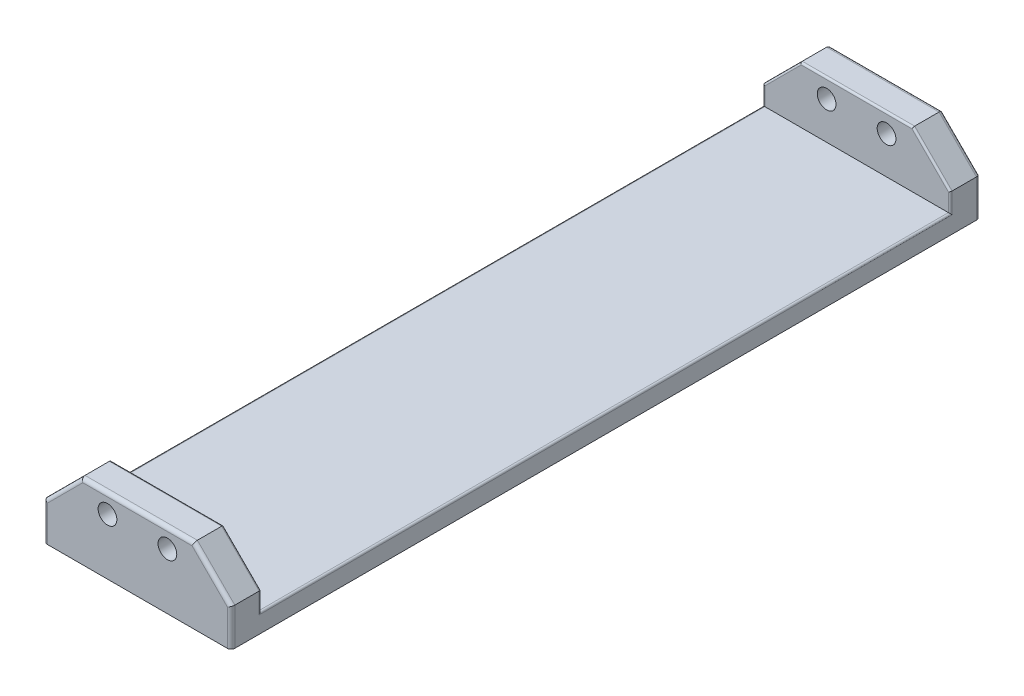
ISO-10303-21;
HEADER;
FILE_DESCRIPTION(('STEP AP214'),'2;1');
FILE_NAME('part.step','',(''),(''),'','','');
FILE_SCHEMA(('AUTOMOTIVE_DESIGN { 1 0 10303 214 1 1 1 1 }'));
ENDSEC;
DATA;
#1=APPLICATION_CONTEXT('core data for automotive mechanical design processes');
#2=APPLICATION_PROTOCOL_DEFINITION('international standard','automotive_design',2000,#1);
#3=PRODUCT_CONTEXT('',#1,'mechanical');
#4=PRODUCT('Part','Part','',(#3));
#5=PRODUCT_RELATED_PRODUCT_CATEGORY('part','',(#4));
#6=PRODUCT_DEFINITION_FORMATION('','',#4);
#7=PRODUCT_DEFINITION_CONTEXT('part definition',#1,'design');
#8=PRODUCT_DEFINITION('design','',#6,#7);
#9=PRODUCT_DEFINITION_SHAPE('','',#8);
#10=(LENGTH_UNIT() NAMED_UNIT(*) SI_UNIT(.MILLI.,.METRE.));
#11=(NAMED_UNIT(*) PLANE_ANGLE_UNIT() SI_UNIT($,.RADIAN.));
#12=(NAMED_UNIT(*) SI_UNIT($,.STERADIAN.) SOLID_ANGLE_UNIT());
#13=UNCERTAINTY_MEASURE_WITH_UNIT(LENGTH_MEASURE(1.E-05),#10,'distance_accuracy_value','');
#14=(GEOMETRIC_REPRESENTATION_CONTEXT(3) GLOBAL_UNCERTAINTY_ASSIGNED_CONTEXT((#13)) GLOBAL_UNIT_ASSIGNED_CONTEXT((#10,
#11,#12)) REPRESENTATION_CONTEXT('',''));
#15=CARTESIAN_POINT('',(0.,0.,0.));
#16=DIRECTION('',(0.,0.,1.));
#17=DIRECTION('',(1.,0.,0.));
#18=AXIS2_PLACEMENT_3D('',#15,#16,#17);
#19=CARTESIAN_POINT('',(-250.,100.,2000.));
#20=DIRECTION('',(0.,-1.,0.));
#21=DIRECTION('',(0.,0.,-1.));
#22=AXIS2_PLACEMENT_3D('',#19,#20,#21);
#23=PLANE('',#22);
#24=DIRECTION('',(0.,0.,1.));
#25=VECTOR('',#24,1.);
#26=CARTESIAN_POINT('',(-150.000000000001,100.,0.));
#27=LINE('',#26,#25);
#28=CARTESIAN_POINT('',(-150.000000000001,100.,10.));
#29=VERTEX_POINT('',#28);
#30=CARTESIAN_POINT('',(-150.000000000001,100.,75.0000000000001));
#31=VERTEX_POINT('',#30);
#32=EDGE_CURVE('E410',#29,#31,#27,.T.);
#33=ORIENTED_EDGE('',*,*,#32,.T.);
#34=DIRECTION('',(-1.,0.,0.));
#35=VECTOR('',#34,1.);
#36=CARTESIAN_POINT('',(-250.,100.,75.0000000000002));
#37=LINE('',#36,#35);
#38=CARTESIAN_POINT('',(150.,100.,75.0000000000001));
#39=VERTEX_POINT('',#38);
#40=EDGE_CURVE('E58',#31,#39,#37,.F.);
#41=ORIENTED_EDGE('',*,*,#40,.T.);
#42=DIRECTION('',(0.,0.,1.));
#43=VECTOR('',#42,1.);
#44=CARTESIAN_POINT('',(150.,100.,0.));
#45=LINE('',#44,#43);
#46=CARTESIAN_POINT('',(150.,100.,10.));
#47=VERTEX_POINT('',#46);
#48=EDGE_CURVE('E393',#47,#39,#45,.T.);
#49=ORIENTED_EDGE('',*,*,#48,.F.);
#50=DIRECTION('',(-1.,0.,0.));
#51=VECTOR('',#50,1.);
#52=CARTESIAN_POINT('',(-250.,100.,10.));
#53=LINE('',#52,#51);
#54=EDGE_CURVE('E276',#47,#29,#53,.T.);
#55=ORIENTED_EDGE('',*,*,#54,.T.);
#56=EDGE_LOOP('',(#33,#41,#49,#55));
#57=FACE_BOUND('',#56,.T.);
#58=ADVANCED_FACE('F34',(#57),#23,.F.);
#59=CARTESIAN_POINT('',(250.,100.,2000.));
#60=DIRECTION('',(-1.,0.,0.));
#61=DIRECTION('',(0.,0.,1.));
#62=AXIS2_PLACEMENT_3D('',#59,#60,#61);
#63=PLANE('',#62);
#64=DIRECTION('',(0.,0.,1.));
#65=VECTOR('',#64,1.);
#66=CARTESIAN_POINT('',(250.,-55.,2000.));
#67=LINE('',#66,#65);
#68=CARTESIAN_POINT('',(250.,-55.,75.0000000000001));
#69=VERTEX_POINT('',#68);
#70=CARTESIAN_POINT('',(250.,-55.,1925.));
#71=VERTEX_POINT('',#70);
#72=EDGE_CURVE('E317',#69,#71,#67,.T.);
#73=ORIENTED_EDGE('',*,*,#72,.T.);
#74=DIRECTION('',(0.,1.,0.));
#75=VECTOR('',#74,1.);
#76=CARTESIAN_POINT('',(250.,100.,1925.));
#77=LINE('',#76,#75);
#78=CARTESIAN_POINT('',(250.,0.,1925.));
#79=VERTEX_POINT('',#78);
#80=EDGE_CURVE('E321',#71,#79,#77,.T.);
#81=ORIENTED_EDGE('',*,*,#80,.T.);
#82=DIRECTION('',(0.,0.,1.));
#83=VECTOR('',#82,1.);
#84=CARTESIAN_POINT('',(250.,0.,0.));
#85=LINE('',#84,#83);
#86=CARTESIAN_POINT('',(250.,0.,1990.));
#87=VERTEX_POINT('',#86);
#88=EDGE_CURVE('E400',#79,#87,#85,.T.);
#89=ORIENTED_EDGE('',*,*,#88,.T.);
#90=DIRECTION('',(0.,1.,0.));
#91=VECTOR('',#90,1.);
#92=CARTESIAN_POINT('',(250.,-100.,1990.));
#93=LINE('',#92,#91);
#94=CARTESIAN_POINT('',(250.,-100.,1990.));
#95=VERTEX_POINT('',#94);
#96=EDGE_CURVE('E228',#87,#95,#93,.F.);
#97=ORIENTED_EDGE('',*,*,#96,.T.);
#98=DIRECTION('',(0.,0.,-1.));
#99=VECTOR('',#98,1.);
#100=CARTESIAN_POINT('',(250.,-100.,2000.));
#101=LINE('',#100,#99);
#102=CARTESIAN_POINT('',(250.,-100.,10.));
#103=VERTEX_POINT('',#102);
#104=EDGE_CURVE('E221',#95,#103,#101,.T.);
#105=ORIENTED_EDGE('',*,*,#104,.T.);
#106=DIRECTION('',(0.,1.,0.));
#107=VECTOR('',#106,1.);
#108=CARTESIAN_POINT('',(250.,100.,10.));
#109=LINE('',#108,#107);
#110=CARTESIAN_POINT('',(250.,0.,10.));
#111=VERTEX_POINT('',#110);
#112=EDGE_CURVE('E280',#103,#111,#109,.T.);
#113=ORIENTED_EDGE('',*,*,#112,.T.);
#114=CARTESIAN_POINT('',(250.,0.,75.));
#115=VERTEX_POINT('',#114);
#116=EDGE_CURVE('E391',#111,#115,#85,.T.);
#117=ORIENTED_EDGE('',*,*,#116,.T.);
#118=DIRECTION('',(0.,-1.,0.));
#119=VECTOR('',#118,1.);
#120=CARTESIAN_POINT('',(250.,100.000000000001,75.0000000000002));
#121=LINE('',#120,#119);
#122=EDGE_CURVE('E319',#115,#69,#121,.T.);
#123=ORIENTED_EDGE('',*,*,#122,.T.);
#124=EDGE_LOOP('',(#73,#81,#89,#97,#105,#113,#117,#123));
#125=FACE_BOUND('',#124,.T.);
#126=ADVANCED_FACE('F395',(#125),#63,.F.);
#127=CARTESIAN_POINT('',(150.,100.,1925.));
#128=VERTEX_POINT('',#127);
#129=CARTESIAN_POINT('',(150.,100.,1990.));
#130=VERTEX_POINT('',#129);
#131=EDGE_CURVE('E409',#128,#130,#45,.T.);
#132=ORIENTED_EDGE('',*,*,#131,.F.);
#133=DIRECTION('',(-1.,0.,0.));
#134=VECTOR('',#133,1.);
#135=CARTESIAN_POINT('',(-250.,100.,1925.));
#136=LINE('',#135,#134);
#137=CARTESIAN_POINT('',(-150.000000000001,100.,1925.));
#138=VERTEX_POINT('',#137);
#139=EDGE_CURVE('E315',#128,#138,#136,.T.);
#140=ORIENTED_EDGE('',*,*,#139,.T.);
#141=CARTESIAN_POINT('',(-150.000000000001,100.,1990.));
#142=VERTEX_POINT('',#141);
#143=EDGE_CURVE('E412',#138,#142,#27,.T.);
#144=ORIENTED_EDGE('',*,*,#143,.T.);
#145=DIRECTION('',(-1.,0.,0.));
#146=VECTOR('',#145,1.);
#147=CARTESIAN_POINT('',(150.,100.,1990.));
#148=LINE('',#147,#146);
#149=EDGE_CURVE('E238',#142,#130,#148,.F.);
#150=ORIENTED_EDGE('',*,*,#149,.T.);
#151=EDGE_LOOP('',(#132,#140,#144,#150));
#152=FACE_BOUND('',#151,.T.);
#153=ADVANCED_FACE('F495',(#152),#23,.F.);
#154=CARTESIAN_POINT('',(-250.,100.,2000.));
#155=DIRECTION('',(1.,0.,0.));
#156=DIRECTION('',(0.,0.,-1.));
#157=AXIS2_PLACEMENT_3D('',#154,#155,#156);
#158=PLANE('',#157);
#159=DIRECTION('',(0.,0.,1.));
#160=VECTOR('',#159,1.);
#161=CARTESIAN_POINT('',(-250.,0.,0.));
#162=LINE('',#161,#160);
#163=CARTESIAN_POINT('',(-250.,0.,1925.));
#164=VERTEX_POINT('',#163);
#165=CARTESIAN_POINT('',(-250.,0.,1990.));
#166=VERTEX_POINT('',#165);
#167=EDGE_CURVE('E399',#164,#166,#162,.T.);
#168=ORIENTED_EDGE('',*,*,#167,.F.);
#169=DIRECTION('',(0.,1.,0.));
#170=VECTOR('',#169,1.);
#171=CARTESIAN_POINT('',(-250.,100.,1925.));
#172=LINE('',#171,#170);
#173=CARTESIAN_POINT('',(-250.,-55.,1925.));
#174=VERTEX_POINT('',#173);
#175=EDGE_CURVE('E311',#164,#174,#172,.F.);
#176=ORIENTED_EDGE('',*,*,#175,.T.);
#177=DIRECTION('',(0.,0.,1.));
#178=VECTOR('',#177,1.);
#179=CARTESIAN_POINT('',(-250.,-55.,2000.));
#180=LINE('',#179,#178);
#181=CARTESIAN_POINT('',(-250.,-55.,75.));
#182=VERTEX_POINT('',#181);
#183=EDGE_CURVE('E307',#174,#182,#180,.F.);
#184=ORIENTED_EDGE('',*,*,#183,.T.);
#185=DIRECTION('',(0.,-1.,0.));
#186=VECTOR('',#185,1.);
#187=CARTESIAN_POINT('',(-250.,100.000000000001,75.));
#188=LINE('',#187,#186);
#189=CARTESIAN_POINT('',(-250.,0.,75.));
#190=VERTEX_POINT('',#189);
#191=EDGE_CURVE('E309',#182,#190,#188,.F.);
#192=ORIENTED_EDGE('',*,*,#191,.T.);
#193=CARTESIAN_POINT('',(-250.,0.,10.));
#194=VERTEX_POINT('',#193);
#195=EDGE_CURVE('E402',#194,#190,#162,.T.);
#196=ORIENTED_EDGE('',*,*,#195,.F.);
#197=DIRECTION('',(0.,-1.,0.));
#198=VECTOR('',#197,1.);
#199=CARTESIAN_POINT('',(-250.,100.,10.));
#200=LINE('',#199,#198);
#201=CARTESIAN_POINT('',(-250.,-100.,10.));
#202=VERTEX_POINT('',#201);
#203=EDGE_CURVE('E245',#194,#202,#200,.T.);
#204=ORIENTED_EDGE('',*,*,#203,.T.);
#205=DIRECTION('',(0.,0.,-1.));
#206=VECTOR('',#205,1.);
#207=CARTESIAN_POINT('',(-250.,-100.,2000.));
#208=LINE('',#207,#206);
#209=CARTESIAN_POINT('',(-250.,-100.,1990.));
#210=VERTEX_POINT('',#209);
#211=EDGE_CURVE('E211',#210,#202,#208,.T.);
#212=ORIENTED_EDGE('',*,*,#211,.F.);
#213=DIRECTION('',(0.,-1.,0.));
#214=VECTOR('',#213,1.);
#215=CARTESIAN_POINT('',(-250.,0.,1990.));
#216=LINE('',#215,#214);
#217=EDGE_CURVE('E227',#210,#166,#216,.F.);
#218=ORIENTED_EDGE('',*,*,#217,.T.);
#219=EDGE_LOOP('',(#168,#176,#184,#192,#196,#204,#212,#218));
#220=FACE_BOUND('',#219,.T.);
#221=ADVANCED_FACE('F460',(#220),#158,.F.);
#222=CARTESIAN_POINT('',(-250.,-100.,2000.));
#223=DIRECTION('',(0.,1.,0.));
#224=DIRECTION('',(0.,0.,1.));
#225=AXIS2_PLACEMENT_3D('',#222,#223,#224);
#226=PLANE('',#225);
#227=ORIENTED_EDGE('',*,*,#211,.T.);
#228=CARTESIAN_POINT('',(-240.,-100.,10.));
#229=DIRECTION('',(0.,1.,0.));
#230=DIRECTION('',(0.,0.,1.));
#231=AXIS2_PLACEMENT_3D('',#228,#229,#230);
#232=CIRCLE('',#231,10.);
#233=CARTESIAN_POINT('',(-240.,-100.,0.));
#234=VERTEX_POINT('',#233);
#235=EDGE_CURVE('E262',#202,#234,#232,.F.);
#236=ORIENTED_EDGE('',*,*,#235,.T.);
#237=DIRECTION('',(1.,0.,0.));
#238=VECTOR('',#237,1.);
#239=CARTESIAN_POINT('',(-250.,-100.,0.));
#240=LINE('',#239,#238);
#241=CARTESIAN_POINT('',(240.,-100.,0.));
#242=VERTEX_POINT('',#241);
#243=EDGE_CURVE('E222',#234,#242,#240,.T.);
#244=ORIENTED_EDGE('',*,*,#243,.T.);
#245=CARTESIAN_POINT('',(240.,-100.,10.));
#246=DIRECTION('',(0.,1.,0.));
#247=DIRECTION('',(0.,0.,1.));
#248=AXIS2_PLACEMENT_3D('',#245,#246,#247);
#249=CIRCLE('',#248,10.);
#250=EDGE_CURVE('E260',#242,#103,#249,.F.);
#251=ORIENTED_EDGE('',*,*,#250,.T.);
#252=ORIENTED_EDGE('',*,*,#104,.F.);
#253=CARTESIAN_POINT('',(240.,-100.,1990.));
#254=DIRECTION('',(0.,1.,0.));
#255=DIRECTION('',(0.,0.,1.));
#256=AXIS2_PLACEMENT_3D('',#253,#254,#255);
#257=CIRCLE('',#256,10.);
#258=CARTESIAN_POINT('',(240.,-100.,2000.));
#259=VERTEX_POINT('',#258);
#260=EDGE_CURVE('E220',#95,#259,#257,.F.);
#261=ORIENTED_EDGE('',*,*,#260,.T.);
#262=DIRECTION('',(1.,0.,0.));
#263=VECTOR('',#262,1.);
#264=CARTESIAN_POINT('',(-250.,-100.,2000.));
#265=LINE('',#264,#263);
#266=CARTESIAN_POINT('',(-240.,-100.,2000.));
#267=VERTEX_POINT('',#266);
#268=EDGE_CURVE('E203',#267,#259,#265,.T.);
#269=ORIENTED_EDGE('',*,*,#268,.F.);
#270=CARTESIAN_POINT('',(-240.,-100.,1990.));
#271=DIRECTION('',(0.,1.,0.));
#272=DIRECTION('',(0.,0.,1.));
#273=AXIS2_PLACEMENT_3D('',#270,#271,#272);
#274=CIRCLE('',#273,10.);
#275=EDGE_CURVE('E216',#267,#210,#274,.F.);
#276=ORIENTED_EDGE('',*,*,#275,.T.);
#277=EDGE_LOOP('',(#227,#236,#244,#251,#252,#261,#269,#276));
#278=FACE_BOUND('',#277,.T.);
#279=ADVANCED_FACE('F215',(#278),#226,.F.);
#280=CARTESIAN_POINT('',(0.,0.,2000.));
#281=DIRECTION('',(0.,0.,1.));
#282=DIRECTION('',(1.,0.,0.));
#283=AXIS2_PLACEMENT_3D('',#280,#281,#282);
#284=PLANE('',#283);
#285=CARTESIAN_POINT('',(80.,50.,2000.));
#286=DIRECTION('',(0.,0.,1.));
#287=DIRECTION('',(1.,0.,0.));
#288=AXIS2_PLACEMENT_3D('',#285,#286,#287);
#289=CIRCLE('',#288,25.);
#290=CARTESIAN_POINT('',(105.,50.,2000.));
#291=VERTEX_POINT('',#290);
#292=EDGE_CURVE('E257',#291,#291,#289,.T.);
#293=ORIENTED_EDGE('',*,*,#292,.F.);
#294=EDGE_LOOP('',(#293));
#295=FACE_BOUND('',#294,.T.);
#296=CARTESIAN_POINT('',(-80.,50.,2000.));
#297=DIRECTION('',(0.,0.,1.));
#298=DIRECTION('',(1.,0.,0.));
#299=AXIS2_PLACEMENT_3D('',#296,#297,#298);
#300=CIRCLE('',#299,25.);
#301=CARTESIAN_POINT('',(-55.,50.,2000.));
#302=VERTEX_POINT('',#301);
#303=EDGE_CURVE('E598',#302,#302,#300,.T.);
#304=ORIENTED_EDGE('',*,*,#303,.F.);
#305=EDGE_LOOP('',(#304));
#306=FACE_BOUND('',#305,.T.);
#307=ORIENTED_EDGE('',*,*,#268,.T.);
#308=DIRECTION('',(0.,1.,0.));
#309=VECTOR('',#308,1.);
#310=CARTESIAN_POINT('',(240.,0.,2000.));
#311=LINE('',#310,#309);
#312=CARTESIAN_POINT('',(240.,-4.14213562373096,2000.));
#313=VERTEX_POINT('',#312);
#314=EDGE_CURVE('E232',#259,#313,#311,.T.);
#315=ORIENTED_EDGE('',*,*,#314,.T.);
#316=DIRECTION('',(0.707106781186549,-0.707106781186546,0.));
#317=VECTOR('',#316,1.);
#318=CARTESIAN_POINT('',(142.928932188134,92.9289321881345,2000.));
#319=LINE('',#318,#317);
#320=CARTESIAN_POINT('',(145.857864376269,90.,2000.));
#321=VERTEX_POINT('',#320);
#322=EDGE_CURVE('E435',#313,#321,#319,.F.);
#323=ORIENTED_EDGE('',*,*,#322,.T.);
#324=DIRECTION('',(-1.,0.,0.));
#325=VECTOR('',#324,1.);
#326=CARTESIAN_POINT('',(-150.000000000001,90.,2000.));
#327=LINE('',#326,#325);
#328=CARTESIAN_POINT('',(-145.85786437627,90.,2000.));
#329=VERTEX_POINT('',#328);
#330=EDGE_CURVE('E433',#321,#329,#327,.T.);
#331=ORIENTED_EDGE('',*,*,#330,.T.);
#332=DIRECTION('',(0.707106781186544,0.707106781186552,0.));
#333=VECTOR('',#332,1.);
#334=CARTESIAN_POINT('',(-242.928932188134,-7.07106781186543,2000.));
#335=LINE('',#334,#333);
#336=CARTESIAN_POINT('',(-240.,-4.1421356237309,2000.));
#337=VERTEX_POINT('',#336);
#338=EDGE_CURVE('E206',#329,#337,#335,.F.);
#339=ORIENTED_EDGE('',*,*,#338,.T.);
#340=DIRECTION('',(0.,-1.,0.));
#341=VECTOR('',#340,1.);
#342=CARTESIAN_POINT('',(-240.,-100.,2000.));
#343=LINE('',#342,#341);
#344=EDGE_CURVE('E199',#337,#267,#343,.T.);
#345=ORIENTED_EDGE('',*,*,#344,.T.);
#346=EDGE_LOOP('',(#307,#315,#323,#331,#339,#345));
#347=FACE_BOUND('',#346,.T.);
#348=ADVANCED_FACE('F201',(#295,#306,#347),#284,.T.);
#349=CARTESIAN_POINT('',(0.,0.,0.));
#350=DIRECTION('',(0.,0.,1.));
#351=DIRECTION('',(1.,0.,0.));
#352=AXIS2_PLACEMENT_3D('',#349,#350,#351);
#353=PLANE('',#352);
#354=CARTESIAN_POINT('',(80.,50.,0.));
#355=DIRECTION('',(0.,0.,1.));
#356=DIRECTION('',(1.,0.,0.));
#357=AXIS2_PLACEMENT_3D('',#354,#355,#356);
#358=CIRCLE('',#357,25.);
#359=CARTESIAN_POINT('',(105.,50.,0.));
#360=VERTEX_POINT('',#359);
#361=EDGE_CURVE('E430',#360,#360,#358,.T.);
#362=ORIENTED_EDGE('',*,*,#361,.T.);
#363=EDGE_LOOP('',(#362));
#364=FACE_BOUND('',#363,.T.);
#365=CARTESIAN_POINT('',(-80.,50.,0.));
#366=DIRECTION('',(0.,0.,1.));
#367=DIRECTION('',(1.,0.,0.));
#368=AXIS2_PLACEMENT_3D('',#365,#366,#367);
#369=CIRCLE('',#368,25.);
#370=CARTESIAN_POINT('',(-55.,50.,0.));
#371=VERTEX_POINT('',#370);
#372=EDGE_CURVE('E426',#371,#371,#369,.T.);
#373=ORIENTED_EDGE('',*,*,#372,.T.);
#374=EDGE_LOOP('',(#373));
#375=FACE_BOUND('',#374,.T.);
#376=ORIENTED_EDGE('',*,*,#243,.F.);
#377=DIRECTION('',(0.,-1.,0.));
#378=VECTOR('',#377,1.);
#379=CARTESIAN_POINT('',(-240.,0.,0.));
#380=LINE('',#379,#378);
#381=CARTESIAN_POINT('',(-240.,-4.14213562373088,0.));
#382=VERTEX_POINT('',#381);
#383=EDGE_CURVE('E272',#234,#382,#380,.F.);
#384=ORIENTED_EDGE('',*,*,#383,.T.);
#385=DIRECTION('',(0.707106781186544,0.707106781186552,0.));
#386=VECTOR('',#385,1.);
#387=CARTESIAN_POINT('',(-117.928932188136,117.928932188135,0.));
#388=LINE('',#387,#386);
#389=CARTESIAN_POINT('',(-145.85786437627,90.,0.));
#390=VERTEX_POINT('',#389);
#391=EDGE_CURVE('E270',#382,#390,#388,.T.);
#392=ORIENTED_EDGE('',*,*,#391,.T.);
#393=DIRECTION('',(-1.,0.,0.));
#394=VECTOR('',#393,1.);
#395=CARTESIAN_POINT('',(0.,90.,0.));
#396=LINE('',#395,#394);
#397=CARTESIAN_POINT('',(145.857864376269,90.,0.));
#398=VERTEX_POINT('',#397);
#399=EDGE_CURVE('E268',#390,#398,#396,.F.);
#400=ORIENTED_EDGE('',*,*,#399,.T.);
#401=DIRECTION('',(0.707106781186549,-0.707106781186546,0.));
#402=VECTOR('',#401,1.);
#403=CARTESIAN_POINT('',(117.928932188134,117.928932188135,0.));
#404=LINE('',#403,#402);
#405=CARTESIAN_POINT('',(240.,-4.14213562373097,0.));
#406=VERTEX_POINT('',#405);
#407=EDGE_CURVE('E266',#398,#406,#404,.T.);
#408=ORIENTED_EDGE('',*,*,#407,.T.);
#409=DIRECTION('',(0.,1.,0.));
#410=VECTOR('',#409,1.);
#411=CARTESIAN_POINT('',(240.,0.,0.));
#412=LINE('',#411,#410);
#413=EDGE_CURVE('E264',#406,#242,#412,.F.);
#414=ORIENTED_EDGE('',*,*,#413,.T.);
#415=EDGE_LOOP('',(#376,#384,#392,#400,#408,#414));
#416=FACE_BOUND('',#415,.T.);
#417=ADVANCED_FACE('F468',(#364,#375,#416),#353,.F.);
#418=CARTESIAN_POINT('',(750.,100.,80.0000000000001));
#419=DIRECTION('',(0.,0.,-1.));
#420=DIRECTION('',(0.,1.,0.));
#421=AXIS2_PLACEMENT_3D('',#418,#419,#420);
#422=PLANE('',#421);
#423=DIRECTION('',(-1.,0.,0.));
#424=VECTOR('',#423,1.);
#425=CARTESIAN_POINT('',(750.,-50.,80.));
#426=LINE('',#425,#424);
#427=CARTESIAN_POINT('',(245.,-50.,80.));
#428=VERTEX_POINT('',#427);
#429=CARTESIAN_POINT('',(-245.,-50.,80.));
#430=VERTEX_POINT('',#429);
#431=EDGE_CURVE('E411',#428,#430,#426,.T.);
#432=ORIENTED_EDGE('',*,*,#431,.F.);
#433=DIRECTION('',(0.,-1.,0.));
#434=VECTOR('',#433,1.);
#435=CARTESIAN_POINT('',(245.,100.,80.0000000000001));
#436=LINE('',#435,#434);
#437=CARTESIAN_POINT('',(245.,-2.0710678118655,80.));
#438=VERTEX_POINT('',#437);
#439=EDGE_CURVE('E331',#428,#438,#436,.F.);
#440=ORIENTED_EDGE('',*,*,#439,.T.);
#441=DIRECTION('',(-0.707106781186549,0.707106781186546,0.));
#442=VECTOR('',#441,1.);
#443=CARTESIAN_POINT('',(446.464466094068,-203.535533905933,79.9999999999999));
#444=LINE('',#443,#442);
#445=CARTESIAN_POINT('',(147.928932188134,95.,80.0000000000001));
#446=VERTEX_POINT('',#445);
#447=EDGE_CURVE('E329',#438,#446,#444,.T.);
#448=ORIENTED_EDGE('',*,*,#447,.T.);
#449=DIRECTION('',(-1.,0.,0.));
#450=VECTOR('',#449,1.);
#451=CARTESIAN_POINT('',(750.,95.,80.0000000000001));
#452=LINE('',#451,#450);
#453=CARTESIAN_POINT('',(-147.928932188135,95.,80.0000000000001));
#454=VERTEX_POINT('',#453);
#455=EDGE_CURVE('E323',#446,#454,#452,.T.);
#456=ORIENTED_EDGE('',*,*,#455,.T.);
#457=DIRECTION('',(-0.707106781186544,-0.707106781186552,0.));
#458=VECTOR('',#457,1.);
#459=CARTESIAN_POINT('',(303.535533905927,546.464466094068,80.0000000000003));
#460=LINE('',#459,#458);
#461=CARTESIAN_POINT('',(-245.,-2.07106781186549,80.));
#462=VERTEX_POINT('',#461);
#463=EDGE_CURVE('E325',#454,#462,#460,.T.);
#464=ORIENTED_EDGE('',*,*,#463,.T.);
#465=DIRECTION('',(0.,-1.,0.));
#466=VECTOR('',#465,1.);
#467=CARTESIAN_POINT('',(-245.,100.,80.0000000000001));
#468=LINE('',#467,#466);
#469=EDGE_CURVE('E327',#462,#430,#468,.T.);
#470=ORIENTED_EDGE('',*,*,#469,.T.);
#471=EDGE_LOOP('',(#432,#440,#448,#456,#464,#470));
#472=FACE_BOUND('',#471,.T.);
#473=CARTESIAN_POINT('',(80.,50.,80.));
#474=DIRECTION('',(0.,0.,-1.));
#475=DIRECTION('',(0.,1.,0.));
#476=AXIS2_PLACEMENT_3D('',#473,#474,#475);
#477=CIRCLE('',#476,25.);
#478=CARTESIAN_POINT('',(80.,75.,80.0000000000001));
#479=VERTEX_POINT('',#478);
#480=EDGE_CURVE('E429',#479,#479,#477,.T.);
#481=ORIENTED_EDGE('',*,*,#480,.T.);
#482=EDGE_LOOP('',(#481));
#483=FACE_BOUND('',#482,.T.);
#484=CARTESIAN_POINT('',(-80.,50.,80.));
#485=DIRECTION('',(0.,0.,-1.));
#486=DIRECTION('',(0.,1.,0.));
#487=AXIS2_PLACEMENT_3D('',#484,#485,#486);
#488=CIRCLE('',#487,25.);
#489=CARTESIAN_POINT('',(-80.,75.,80.0000000000001));
#490=VERTEX_POINT('',#489);
#491=EDGE_CURVE('E406',#490,#490,#488,.T.);
#492=ORIENTED_EDGE('',*,*,#491,.T.);
#493=EDGE_LOOP('',(#492));
#494=FACE_BOUND('',#493,.T.);
#495=ADVANCED_FACE('F532',(#472,#483,#494),#422,.F.);
#496=CARTESIAN_POINT('',(750.,100.,1920.));
#497=DIRECTION('',(0.,0.,1.));
#498=DIRECTION('',(1.,0.,0.));
#499=AXIS2_PLACEMENT_3D('',#496,#497,#498);
#500=PLANE('',#499);
#501=CARTESIAN_POINT('',(80.,50.,1920.));
#502=DIRECTION('',(0.,0.,1.));
#503=DIRECTION('',(1.,0.,0.));
#504=AXIS2_PLACEMENT_3D('',#501,#502,#503);
#505=CIRCLE('',#504,25.);
#506=CARTESIAN_POINT('',(105.,50.,1920.));
#507=VERTEX_POINT('',#506);
#508=EDGE_CURVE('E427',#507,#507,#505,.T.);
#509=ORIENTED_EDGE('',*,*,#508,.T.);
#510=EDGE_LOOP('',(#509));
#511=FACE_BOUND('',#510,.T.);
#512=CARTESIAN_POINT('',(-80.,50.,1920.));
#513=DIRECTION('',(0.,0.,1.));
#514=DIRECTION('',(1.,0.,0.));
#515=AXIS2_PLACEMENT_3D('',#512,#513,#514);
#516=CIRCLE('',#515,25.);
#517=CARTESIAN_POINT('',(-55.,50.,1920.));
#518=VERTEX_POINT('',#517);
#519=EDGE_CURVE('E423',#518,#518,#516,.T.);
#520=ORIENTED_EDGE('',*,*,#519,.T.);
#521=EDGE_LOOP('',(#520));
#522=FACE_BOUND('',#521,.T.);
#523=DIRECTION('',(-1.,0.,0.));
#524=VECTOR('',#523,1.);
#525=CARTESIAN_POINT('',(750.,-50.,1920.));
#526=LINE('',#525,#524);
#527=CARTESIAN_POINT('',(245.,-50.,1920.));
#528=VERTEX_POINT('',#527);
#529=CARTESIAN_POINT('',(-245.,-50.,1920.));
#530=VERTEX_POINT('',#529);
#531=EDGE_CURVE('E414',#528,#530,#526,.T.);
#532=ORIENTED_EDGE('',*,*,#531,.T.);
#533=DIRECTION('',(0.,1.,0.));
#534=VECTOR('',#533,1.);
#535=CARTESIAN_POINT('',(-245.,100.,1920.));
#536=LINE('',#535,#534);
#537=CARTESIAN_POINT('',(-245.,-2.0710678118655,1920.));
#538=VERTEX_POINT('',#537);
#539=EDGE_CURVE('E302',#530,#538,#536,.T.);
#540=ORIENTED_EDGE('',*,*,#539,.T.);
#541=DIRECTION('',(0.707106781186544,0.707106781186552,0.));
#542=VECTOR('',#541,1.);
#543=CARTESIAN_POINT('',(303.535533905927,546.464466094068,1920.));
#544=LINE('',#543,#542);
#545=CARTESIAN_POINT('',(-147.928932188135,95.,1920.));
#546=VERTEX_POINT('',#545);
#547=EDGE_CURVE('E300',#538,#546,#544,.T.);
#548=ORIENTED_EDGE('',*,*,#547,.T.);
#549=DIRECTION('',(-1.,0.,0.));
#550=VECTOR('',#549,1.);
#551=CARTESIAN_POINT('',(750.,95.,1920.));
#552=LINE('',#551,#550);
#553=CARTESIAN_POINT('',(147.928932188134,95.,1920.));
#554=VERTEX_POINT('',#553);
#555=EDGE_CURVE('E298',#546,#554,#552,.F.);
#556=ORIENTED_EDGE('',*,*,#555,.T.);
#557=DIRECTION('',(0.707106781186549,-0.707106781186546,0.));
#558=VECTOR('',#557,1.);
#559=CARTESIAN_POINT('',(446.464466094068,-203.535533905933,1920.));
#560=LINE('',#559,#558);
#561=CARTESIAN_POINT('',(245.,-2.07106781186548,1920.));
#562=VERTEX_POINT('',#561);
#563=EDGE_CURVE('E295',#554,#562,#560,.T.);
#564=ORIENTED_EDGE('',*,*,#563,.T.);
#565=DIRECTION('',(0.,1.,0.));
#566=VECTOR('',#565,1.);
#567=CARTESIAN_POINT('',(245.,100.,1920.));
#568=LINE('',#567,#566);
#569=EDGE_CURVE('E282',#562,#528,#568,.F.);
#570=ORIENTED_EDGE('',*,*,#569,.T.);
#571=EDGE_LOOP('',(#532,#540,#548,#556,#564,#570));
#572=FACE_BOUND('',#571,.T.);
#573=ADVANCED_FACE('F521',(#511,#522,#572),#500,.F.);
#574=CARTESIAN_POINT('',(750.,-50.,80.));
#575=DIRECTION('',(0.,-1.,0.));
#576=DIRECTION('',(0.,0.,-1.));
#577=AXIS2_PLACEMENT_3D('',#574,#575,#576);
#578=PLANE('',#577);
#579=ORIENTED_EDGE('',*,*,#531,.F.);
#580=DIRECTION('',(0.,0.,1.));
#581=VECTOR('',#580,1.);
#582=CARTESIAN_POINT('',(245.,-50.,80.));
#583=LINE('',#582,#581);
#584=EDGE_CURVE('E11',#528,#428,#583,.F.);
#585=ORIENTED_EDGE('',*,*,#584,.T.);
#586=ORIENTED_EDGE('',*,*,#431,.T.);
#587=DIRECTION('',(0.,0.,1.));
#588=VECTOR('',#587,1.);
#589=CARTESIAN_POINT('',(-245.,-50.,80.));
#590=LINE('',#589,#588);
#591=EDGE_CURVE('E43',#430,#530,#590,.T.);
#592=ORIENTED_EDGE('',*,*,#591,.T.);
#593=EDGE_LOOP('',(#579,#585,#586,#592));
#594=FACE_BOUND('',#593,.T.);
#595=ADVANCED_FACE('F517',(#594),#578,.F.);
#596=CARTESIAN_POINT('',(-250.,0.,0.));
#597=DIRECTION('',(0.707106781186552,-0.707106781186544,0.));
#598=DIRECTION('',(0.707106781186544,0.707106781186552,0.));
#599=AXIS2_PLACEMENT_3D('',#596,#597,#598);
#600=PLANE('',#599);
#601=ORIENTED_EDGE('',*,*,#143,.F.);
#602=DIRECTION('',(0.707106781186544,0.707106781186552,0.));
#603=VECTOR('',#602,1.);
#604=CARTESIAN_POINT('',(-250.,0.,1925.));
#605=LINE('',#604,#603);
#606=EDGE_CURVE('E313',#138,#164,#605,.F.);
#607=ORIENTED_EDGE('',*,*,#606,.T.);
#608=ORIENTED_EDGE('',*,*,#167,.T.);
#609=DIRECTION('',(0.707106781186544,0.707106781186552,0.));
#610=VECTOR('',#609,1.);
#611=CARTESIAN_POINT('',(-150.000000000001,100.,1990.));
#612=LINE('',#611,#610);
#613=EDGE_CURVE('E241',#166,#142,#612,.T.);
#614=ORIENTED_EDGE('',*,*,#613,.T.);
#615=EDGE_LOOP('',(#601,#607,#608,#614));
#616=FACE_BOUND('',#615,.T.);
#617=ADVANCED_FACE('F455',(#616),#600,.F.);
#618=ORIENTED_EDGE('',*,*,#195,.T.);
#619=DIRECTION('',(-0.707106781186544,-0.707106781186552,0.));
#620=VECTOR('',#619,1.);
#621=CARTESIAN_POINT('',(-250.,0.,75.));
#622=LINE('',#621,#620);
#623=EDGE_CURVE('E51',#190,#31,#622,.F.);
#624=ORIENTED_EDGE('',*,*,#623,.T.);
#625=ORIENTED_EDGE('',*,*,#32,.F.);
#626=DIRECTION('',(0.707106781186544,0.707106781186552,0.));
#627=VECTOR('',#626,1.);
#628=CARTESIAN_POINT('',(-250.,0.,10.));
#629=LINE('',#628,#627);
#630=EDGE_CURVE('E274',#29,#194,#629,.F.);
#631=ORIENTED_EDGE('',*,*,#630,.T.);
#632=EDGE_LOOP('',(#618,#624,#625,#631));
#633=FACE_BOUND('',#632,.T.);
#634=ADVANCED_FACE('F573',(#633),#600,.F.);
#635=CARTESIAN_POINT('',(250.,0.,0.));
#636=DIRECTION('',(-0.707106781186546,-0.707106781186549,0.));
#637=DIRECTION('',(0.707106781186549,-0.707106781186546,0.));
#638=AXIS2_PLACEMENT_3D('',#635,#636,#637);
#639=PLANE('',#638);
#640=ORIENTED_EDGE('',*,*,#88,.F.);
#641=DIRECTION('',(0.707106781186549,-0.707106781186546,0.));
#642=VECTOR('',#641,1.);
#643=CARTESIAN_POINT('',(250.,0.,1925.));
#644=LINE('',#643,#642);
#645=EDGE_CURVE('E304',#79,#128,#644,.F.);
#646=ORIENTED_EDGE('',*,*,#645,.T.);
#647=ORIENTED_EDGE('',*,*,#131,.T.);
#648=DIRECTION('',(0.707106781186549,-0.707106781186546,0.));
#649=VECTOR('',#648,1.);
#650=CARTESIAN_POINT('',(250.,0.,1990.));
#651=LINE('',#650,#649);
#652=EDGE_CURVE('E230',#130,#87,#651,.T.);
#653=ORIENTED_EDGE('',*,*,#652,.T.);
#654=EDGE_LOOP('',(#640,#646,#647,#653));
#655=FACE_BOUND('',#654,.T.);
#656=ADVANCED_FACE('F492',(#655),#639,.F.);
#657=ORIENTED_EDGE('',*,*,#48,.T.);
#658=DIRECTION('',(-0.707106781186549,0.707106781186546,0.));
#659=VECTOR('',#658,1.);
#660=CARTESIAN_POINT('',(250.,0.,75.));
#661=LINE('',#660,#659);
#662=EDGE_CURVE('E333',#39,#115,#661,.F.);
#663=ORIENTED_EDGE('',*,*,#662,.T.);
#664=ORIENTED_EDGE('',*,*,#116,.F.);
#665=DIRECTION('',(0.707106781186549,-0.707106781186546,0.));
#666=VECTOR('',#665,1.);
#667=CARTESIAN_POINT('',(250.,0.,10.));
#668=LINE('',#667,#666);
#669=EDGE_CURVE('E278',#111,#47,#668,.F.);
#670=ORIENTED_EDGE('',*,*,#669,.T.);
#671=EDGE_LOOP('',(#657,#663,#664,#670));
#672=FACE_BOUND('',#671,.T.);
#673=ADVANCED_FACE('F390',(#672),#639,.F.);
#674=CARTESIAN_POINT('',(-80.,50.,0.));
#675=DIRECTION('',(0.,0.,1.));
#676=DIRECTION('',(1.,0.,0.));
#677=AXIS2_PLACEMENT_3D('',#674,#675,#676);
#678=CYLINDRICAL_SURFACE('',#677,25.);
#679=ORIENTED_EDGE('',*,*,#303,.T.);
#680=EDGE_LOOP('',(#679));
#681=FACE_BOUND('',#680,.T.);
#682=ORIENTED_EDGE('',*,*,#519,.F.);
#683=EDGE_LOOP('',(#682));
#684=FACE_BOUND('',#683,.T.);
#685=ADVANCED_FACE('F578',(#681,#684),#678,.F.);
#686=ORIENTED_EDGE('',*,*,#372,.F.);
#687=EDGE_LOOP('',(#686));
#688=FACE_BOUND('',#687,.T.);
#689=ORIENTED_EDGE('',*,*,#491,.F.);
#690=EDGE_LOOP('',(#689));
#691=FACE_BOUND('',#690,.T.);
#692=ADVANCED_FACE('F579',(#688,#691),#678,.F.);
#693=CARTESIAN_POINT('',(80.,50.,0.));
#694=DIRECTION('',(0.,0.,1.));
#695=DIRECTION('',(1.,0.,0.));
#696=AXIS2_PLACEMENT_3D('',#693,#694,#695);
#697=CYLINDRICAL_SURFACE('',#696,25.);
#698=ORIENTED_EDGE('',*,*,#292,.T.);
#699=EDGE_LOOP('',(#698));
#700=FACE_BOUND('',#699,.T.);
#701=ORIENTED_EDGE('',*,*,#508,.F.);
#702=EDGE_LOOP('',(#701));
#703=FACE_BOUND('',#702,.T.);
#704=ADVANCED_FACE('F582',(#700,#703),#697,.F.);
#705=ORIENTED_EDGE('',*,*,#361,.F.);
#706=EDGE_LOOP('',(#705));
#707=FACE_BOUND('',#706,.T.);
#708=ORIENTED_EDGE('',*,*,#480,.F.);
#709=EDGE_LOOP('',(#708));
#710=FACE_BOUND('',#709,.T.);
#711=ADVANCED_FACE('F584',(#707,#710),#697,.F.);
#712=CARTESIAN_POINT('',(-240.,0.,1990.));
#713=DIRECTION('',(0.,1.,0.));
#714=DIRECTION('',(0.,0.,1.));
#715=AXIS2_PLACEMENT_3D('',#712,#713,#714);
#716=CYLINDRICAL_SURFACE('',#715,10.);
#717=ORIENTED_EDGE('',*,*,#275,.F.);
#718=ORIENTED_EDGE('',*,*,#344,.F.);
#719=CARTESIAN_POINT('',(-240.,-4.1421356237309,1990.));
#720=DIRECTION('',(0.382683432365087,0.923879532511288,0.));
#721=DIRECTION('',(-0.923879532511288,0.382683432365087,0.));
#722=AXIS2_PLACEMENT_3D('',#719,#720,#721);
#723=ELLIPSE('',#722,10.8239220029239,10.);
#724=EDGE_CURVE('E255',#166,#337,#723,.T.);
#725=ORIENTED_EDGE('',*,*,#724,.F.);
#726=ORIENTED_EDGE('',*,*,#217,.F.);
#727=EDGE_LOOP('',(#717,#718,#725,#726));
#728=FACE_BOUND('',#727,.T.);
#729=ADVANCED_FACE('F225',(#728),#716,.T.);
#730=CARTESIAN_POINT('',(-242.928932188134,-7.07106781186544,1990.));
#731=DIRECTION('',(-0.707106781186544,-0.707106781186552,0.));
#732=DIRECTION('',(0.707106781186552,-0.707106781186544,0.));
#733=AXIS2_PLACEMENT_3D('',#730,#731,#732);
#734=CYLINDRICAL_SURFACE('',#733,10.);
#735=ORIENTED_EDGE('',*,*,#724,.T.);
#736=ORIENTED_EDGE('',*,*,#338,.F.);
#737=CARTESIAN_POINT('',(-145.85786437627,90.,1990.));
#738=DIRECTION('',(-0.923879532511286,-0.382683432365092,0.));
#739=DIRECTION('',(0.382683432365092,-0.923879532511286,0.));
#740=AXIS2_PLACEMENT_3D('',#737,#738,#739);
#741=ELLIPSE('',#740,10.823922002924,10.);
#742=EDGE_CURVE('E252',#142,#329,#741,.F.);
#743=ORIENTED_EDGE('',*,*,#742,.F.);
#744=ORIENTED_EDGE('',*,*,#613,.F.);
#745=EDGE_LOOP('',(#735,#736,#743,#744));
#746=FACE_BOUND('',#745,.T.);
#747=ADVANCED_FACE('F451',(#746),#734,.T.);
#748=CARTESIAN_POINT('',(0.,90.,1990.));
#749=DIRECTION('',(1.,0.,0.));
#750=DIRECTION('',(0.,0.,-1.));
#751=AXIS2_PLACEMENT_3D('',#748,#749,#750);
#752=CYLINDRICAL_SURFACE('',#751,10.);
#753=ORIENTED_EDGE('',*,*,#742,.T.);
#754=ORIENTED_EDGE('',*,*,#330,.F.);
#755=CARTESIAN_POINT('',(145.857864376269,90.,1990.));
#756=DIRECTION('',(0.923879532511287,-0.382683432365089,0.));
#757=DIRECTION('',(0.382683432365089,0.923879532511287,0.));
#758=AXIS2_PLACEMENT_3D('',#755,#756,#757);
#759=ELLIPSE('',#758,10.8239220029239,10.);
#760=EDGE_CURVE('E248',#130,#321,#759,.T.);
#761=ORIENTED_EDGE('',*,*,#760,.F.);
#762=ORIENTED_EDGE('',*,*,#149,.F.);
#763=EDGE_LOOP('',(#753,#754,#761,#762));
#764=FACE_BOUND('',#763,.T.);
#765=ADVANCED_FACE('F448',(#764),#752,.T.);
#766=CARTESIAN_POINT('',(242.928932188135,-7.07106781186549,1990.));
#767=DIRECTION('',(-0.707106781186549,0.707106781186546,0.));
#768=DIRECTION('',(-0.707106781186546,-0.707106781186549,0.));
#769=AXIS2_PLACEMENT_3D('',#766,#767,#768);
#770=CYLINDRICAL_SURFACE('',#769,10.);
#771=ORIENTED_EDGE('',*,*,#760,.T.);
#772=ORIENTED_EDGE('',*,*,#322,.F.);
#773=CARTESIAN_POINT('',(240.,-4.14213562373094,1990.));
#774=DIRECTION('',(-0.382683432365091,0.923879532511286,0.));
#775=DIRECTION('',(-0.923879532511286,-0.382683432365091,0.));
#776=AXIS2_PLACEMENT_3D('',#773,#774,#775);
#777=ELLIPSE('',#776,10.8239220029239,10.);
#778=EDGE_CURVE('E246',#87,#313,#777,.F.);
#779=ORIENTED_EDGE('',*,*,#778,.F.);
#780=ORIENTED_EDGE('',*,*,#652,.F.);
#781=EDGE_LOOP('',(#771,#772,#779,#780));
#782=FACE_BOUND('',#781,.T.);
#783=ADVANCED_FACE('F444',(#782),#770,.T.);
#784=CARTESIAN_POINT('',(240.,0.,1990.));
#785=DIRECTION('',(0.,-1.,0.));
#786=DIRECTION('',(0.,0.,-1.));
#787=AXIS2_PLACEMENT_3D('',#784,#785,#786);
#788=CYLINDRICAL_SURFACE('',#787,10.);
#789=ORIENTED_EDGE('',*,*,#260,.F.);
#790=ORIENTED_EDGE('',*,*,#96,.F.);
#791=ORIENTED_EDGE('',*,*,#778,.T.);
#792=ORIENTED_EDGE('',*,*,#314,.F.);
#793=EDGE_LOOP('',(#789,#790,#791,#792));
#794=FACE_BOUND('',#793,.T.);
#795=ADVANCED_FACE('F439',(#794),#788,.T.);
#796=CARTESIAN_POINT('',(240.,100.,10.));
#797=DIRECTION('',(0.,1.,0.));
#798=DIRECTION('',(0.,0.,1.));
#799=AXIS2_PLACEMENT_3D('',#796,#797,#798);
#800=CYLINDRICAL_SURFACE('',#799,10.);
#801=ORIENTED_EDGE('',*,*,#250,.F.);
#802=ORIENTED_EDGE('',*,*,#413,.F.);
#803=CARTESIAN_POINT('',(240.,-4.14213562373096,10.));
#804=DIRECTION('',(-0.382683432365091,0.923879532511286,0.));
#805=DIRECTION('',(0.923879532511286,0.382683432365091,0.));
#806=AXIS2_PLACEMENT_3D('',#803,#804,#805);
#807=ELLIPSE('',#806,10.8239220029239,10.);
#808=EDGE_CURVE('E249',#111,#406,#807,.T.);
#809=ORIENTED_EDGE('',*,*,#808,.F.);
#810=ORIENTED_EDGE('',*,*,#112,.F.);
#811=EDGE_LOOP('',(#801,#802,#809,#810));
#812=FACE_BOUND('',#811,.T.);
#813=ADVANCED_FACE('F487',(#812),#800,.T.);
#814=CARTESIAN_POINT('',(117.928932188134,117.928932188135,10.));
#815=DIRECTION('',(0.707106781186549,-0.707106781186546,0.));
#816=DIRECTION('',(0.707106781186546,0.707106781186549,0.));
#817=AXIS2_PLACEMENT_3D('',#814,#815,#816);
#818=CYLINDRICAL_SURFACE('',#817,10.);
#819=ORIENTED_EDGE('',*,*,#808,.T.);
#820=ORIENTED_EDGE('',*,*,#407,.F.);
#821=CARTESIAN_POINT('',(145.857864376269,90.,10.));
#822=DIRECTION('',(0.923879532511287,-0.382683432365089,0.));
#823=DIRECTION('',(-0.382683432365089,-0.923879532511287,0.));
#824=AXIS2_PLACEMENT_3D('',#821,#822,#823);
#825=ELLIPSE('',#824,10.8239220029239,10.);
#826=EDGE_CURVE('E289',#47,#398,#825,.F.);
#827=ORIENTED_EDGE('',*,*,#826,.F.);
#828=ORIENTED_EDGE('',*,*,#669,.F.);
#829=EDGE_LOOP('',(#819,#820,#827,#828));
#830=FACE_BOUND('',#829,.T.);
#831=ADVANCED_FACE('F485',(#830),#818,.T.);
#832=CARTESIAN_POINT('',(-250.,90.,10.));
#833=DIRECTION('',(-1.,0.,0.));
#834=DIRECTION('',(0.,0.,1.));
#835=AXIS2_PLACEMENT_3D('',#832,#833,#834);
#836=CYLINDRICAL_SURFACE('',#835,10.);
#837=ORIENTED_EDGE('',*,*,#826,.T.);
#838=ORIENTED_EDGE('',*,*,#399,.F.);
#839=CARTESIAN_POINT('',(-145.85786437627,90.,10.));
#840=DIRECTION('',(-0.923879532511286,-0.382683432365092,0.));
#841=DIRECTION('',(-0.382683432365092,0.923879532511286,0.));
#842=AXIS2_PLACEMENT_3D('',#839,#840,#841);
#843=ELLIPSE('',#842,10.823922002924,10.);
#844=EDGE_CURVE('E286',#29,#390,#843,.T.);
#845=ORIENTED_EDGE('',*,*,#844,.F.);
#846=ORIENTED_EDGE('',*,*,#54,.F.);
#847=EDGE_LOOP('',(#837,#838,#845,#846));
#848=FACE_BOUND('',#847,.T.);
#849=ADVANCED_FACE('F480',(#848),#836,.T.);
#850=CARTESIAN_POINT('',(-117.928932188136,117.928932188135,10.));
#851=DIRECTION('',(0.707106781186544,0.707106781186552,0.));
#852=DIRECTION('',(-0.707106781186552,0.707106781186544,0.));
#853=AXIS2_PLACEMENT_3D('',#850,#851,#852);
#854=CYLINDRICAL_SURFACE('',#853,10.);
#855=ORIENTED_EDGE('',*,*,#844,.T.);
#856=ORIENTED_EDGE('',*,*,#391,.F.);
#857=CARTESIAN_POINT('',(-240.,-4.14213562373089,10.));
#858=DIRECTION('',(0.382683432365087,0.923879532511288,0.));
#859=DIRECTION('',(0.923879532511288,-0.382683432365087,0.));
#860=AXIS2_PLACEMENT_3D('',#857,#858,#859);
#861=ELLIPSE('',#860,10.8239220029239,10.);
#862=EDGE_CURVE('E283',#194,#382,#861,.F.);
#863=ORIENTED_EDGE('',*,*,#862,.F.);
#864=ORIENTED_EDGE('',*,*,#630,.F.);
#865=EDGE_LOOP('',(#855,#856,#863,#864));
#866=FACE_BOUND('',#865,.T.);
#867=ADVANCED_FACE('F475',(#866),#854,.T.);
#868=CARTESIAN_POINT('',(-240.,100.,10.));
#869=DIRECTION('',(0.,-1.,0.));
#870=DIRECTION('',(0.,0.,-1.));
#871=AXIS2_PLACEMENT_3D('',#868,#869,#870);
#872=CYLINDRICAL_SURFACE('',#871,10.);
#873=ORIENTED_EDGE('',*,*,#862,.T.);
#874=ORIENTED_EDGE('',*,*,#383,.F.);
#875=ORIENTED_EDGE('',*,*,#235,.F.);
#876=ORIENTED_EDGE('',*,*,#203,.F.);
#877=EDGE_LOOP('',(#873,#874,#875,#876));
#878=FACE_BOUND('',#877,.T.);
#879=ADVANCED_FACE('F471',(#878),#872,.T.);
#880=CARTESIAN_POINT('',(303.535533905927,546.464466094068,75.0000000000003));
#881=DIRECTION('',(-0.707106781186544,-0.707106781186552,0.));
#882=DIRECTION('',(0.707106781186552,-0.707106781186544,0.));
#883=AXIS2_PLACEMENT_3D('',#880,#881,#882);
#884=CYLINDRICAL_SURFACE('',#883,5.);
#885=CARTESIAN_POINT('',(-147.928932188135,95.,75.0000000000001));
#886=DIRECTION('',(-0.923879532511286,-0.382683432365092,0.));
#887=DIRECTION('',(-0.382683432365092,0.923879532511286,0.));
#888=AXIS2_PLACEMENT_3D('',#885,#886,#887);
#889=ELLIPSE('',#888,5.41196100146198,5.);
#890=EDGE_CURVE('E365',#31,#454,#889,.F.);
#891=ORIENTED_EDGE('',*,*,#890,.F.);
#892=ORIENTED_EDGE('',*,*,#623,.F.);
#893=CARTESIAN_POINT('',(-245.,-2.0710678118655,75.));
#894=DIRECTION('',(-0.382683432365087,-0.923879532511288,0.));
#895=DIRECTION('',(-0.923879532511288,0.382683432365087,0.));
#896=AXIS2_PLACEMENT_3D('',#893,#894,#895);
#897=ELLIPSE('',#896,5.41196100146196,5.);
#898=EDGE_CURVE('E38',#462,#190,#897,.T.);
#899=ORIENTED_EDGE('',*,*,#898,.F.);
#900=ORIENTED_EDGE('',*,*,#463,.F.);
#901=EDGE_LOOP('',(#891,#892,#899,#900));
#902=FACE_BOUND('',#901,.T.);
#903=ADVANCED_FACE('F36',(#902),#884,.T.);
#904=CARTESIAN_POINT('',(-245.,100.,75.0000000000001));
#905=DIRECTION('',(0.,-1.,0.));
#906=DIRECTION('',(0.,0.,-1.));
#907=AXIS2_PLACEMENT_3D('',#904,#905,#906);
#908=CYLINDRICAL_SURFACE('',#907,5.);
#909=ORIENTED_EDGE('',*,*,#898,.T.);
#910=ORIENTED_EDGE('',*,*,#191,.F.);
#911=CARTESIAN_POINT('',(-245.,-55.,75.));
#912=DIRECTION('',(0.,-0.707106781186548,0.707106781186547));
#913=DIRECTION('',(0.,-0.707106781186547,-0.707106781186548));
#914=AXIS2_PLACEMENT_3D('',#911,#912,#913);
#915=ELLIPSE('',#914,7.07106781186548,5.);
#916=EDGE_CURVE('E363',#430,#182,#915,.T.);
#917=ORIENTED_EDGE('',*,*,#916,.F.);
#918=ORIENTED_EDGE('',*,*,#469,.F.);
#919=EDGE_LOOP('',(#909,#910,#917,#918));
#920=FACE_BOUND('',#919,.T.);
#921=ADVANCED_FACE('F375',(#920),#908,.T.);
#922=CARTESIAN_POINT('',(750.,95.,75.0000000000001));
#923=DIRECTION('',(-1.,0.,0.));
#924=DIRECTION('',(0.,0.,1.));
#925=AXIS2_PLACEMENT_3D('',#922,#923,#924);
#926=CYLINDRICAL_SURFACE('',#925,5.);
#927=ORIENTED_EDGE('',*,*,#890,.T.);
#928=ORIENTED_EDGE('',*,*,#455,.F.);
#929=CARTESIAN_POINT('',(147.928932188134,95.,75.0000000000001));
#930=DIRECTION('',(-0.923879532511287,0.382683432365089,0.));
#931=DIRECTION('',(-0.382683432365089,-0.923879532511287,0.));
#932=AXIS2_PLACEMENT_3D('',#929,#930,#931);
#933=ELLIPSE('',#932,5.41196100146197,5.);
#934=EDGE_CURVE('E360',#39,#446,#933,.F.);
#935=ORIENTED_EDGE('',*,*,#934,.F.);
#936=ORIENTED_EDGE('',*,*,#40,.F.);
#937=EDGE_LOOP('',(#927,#928,#935,#936));
#938=FACE_BOUND('',#937,.T.);
#939=ADVANCED_FACE('F380',(#938),#926,.T.);
#940=CARTESIAN_POINT('',(-245.,-55.,80.));
#941=DIRECTION('',(0.,0.,1.));
#942=DIRECTION('',(1.,0.,0.));
#943=AXIS2_PLACEMENT_3D('',#940,#941,#942);
#944=CYLINDRICAL_SURFACE('',#943,5.);
#945=ORIENTED_EDGE('',*,*,#916,.T.);
#946=ORIENTED_EDGE('',*,*,#183,.F.);
#947=CARTESIAN_POINT('',(-245.,-55.,1925.));
#948=DIRECTION('',(0.,0.707106781186547,0.707106781186547));
#949=DIRECTION('',(0.,0.707106781186547,-0.707106781186547));
#950=AXIS2_PLACEMENT_3D('',#947,#948,#949);
#951=ELLIPSE('',#950,7.07106781186547,5.);
#952=EDGE_CURVE('E357',#530,#174,#951,.T.);
#953=ORIENTED_EDGE('',*,*,#952,.F.);
#954=ORIENTED_EDGE('',*,*,#591,.F.);
#955=EDGE_LOOP('',(#945,#946,#953,#954));
#956=FACE_BOUND('',#955,.T.);
#957=ADVANCED_FACE('F513',(#956),#944,.T.);
#958=CARTESIAN_POINT('',(446.464466094068,-203.535533905933,74.9999999999999));
#959=DIRECTION('',(-0.707106781186549,0.707106781186546,0.));
#960=DIRECTION('',(-0.707106781186546,-0.707106781186549,0.));
#961=AXIS2_PLACEMENT_3D('',#958,#959,#960);
#962=CYLINDRICAL_SURFACE('',#961,5.);
#963=ORIENTED_EDGE('',*,*,#934,.T.);
#964=ORIENTED_EDGE('',*,*,#447,.F.);
#965=CARTESIAN_POINT('',(245.,-2.07106781186553,75.0000000000001));
#966=DIRECTION('',(-0.382683432365091,0.923879532511286,0.));
#967=DIRECTION('',(-0.923879532511286,-0.382683432365091,0.));
#968=AXIS2_PLACEMENT_3D('',#965,#966,#967);
#969=ELLIPSE('',#968,5.41196100146197,5.);
#970=EDGE_CURVE('E354',#115,#438,#969,.F.);
#971=ORIENTED_EDGE('',*,*,#970,.F.);
#972=ORIENTED_EDGE('',*,*,#662,.F.);
#973=EDGE_LOOP('',(#963,#964,#971,#972));
#974=FACE_BOUND('',#973,.T.);
#975=ADVANCED_FACE('F385',(#974),#962,.T.);
#976=CARTESIAN_POINT('',(-245.,100.,1925.));
#977=DIRECTION('',(0.,1.,0.));
#978=DIRECTION('',(0.,0.,1.));
#979=AXIS2_PLACEMENT_3D('',#976,#977,#978);
#980=CYLINDRICAL_SURFACE('',#979,5.);
#981=ORIENTED_EDGE('',*,*,#952,.T.);
#982=ORIENTED_EDGE('',*,*,#175,.F.);
#983=CARTESIAN_POINT('',(-245.,-2.0710678118655,1925.));
#984=DIRECTION('',(0.382683432365087,0.923879532511288,0.));
#985=DIRECTION('',(0.923879532511288,-0.382683432365087,0.));
#986=AXIS2_PLACEMENT_3D('',#983,#984,#985);
#987=ELLIPSE('',#986,5.41196100146196,5.);
#988=EDGE_CURVE('E351',#538,#164,#987,.T.);
#989=ORIENTED_EDGE('',*,*,#988,.F.);
#990=ORIENTED_EDGE('',*,*,#539,.F.);
#991=EDGE_LOOP('',(#981,#982,#989,#990));
#992=FACE_BOUND('',#991,.T.);
#993=ADVANCED_FACE('F509',(#992),#980,.T.);
#994=CARTESIAN_POINT('',(245.,100.000000000001,75.0000000000002));
#995=DIRECTION('',(0.,-1.,0.));
#996=DIRECTION('',(0.,0.,-1.));
#997=AXIS2_PLACEMENT_3D('',#994,#995,#996);
#998=CYLINDRICAL_SURFACE('',#997,5.);
#999=ORIENTED_EDGE('',*,*,#970,.T.);
#1000=ORIENTED_EDGE('',*,*,#439,.F.);
#1001=CARTESIAN_POINT('',(245.,-55.,75.0000000000002));
#1002=DIRECTION('',(0.,-0.707106781186548,0.707106781186547));
#1003=DIRECTION('',(0.,-0.707106781186547,-0.707106781186548));
#1004=AXIS2_PLACEMENT_3D('',#1001,#1002,#1003);
#1005=ELLIPSE('',#1004,7.07106781186548,5.);
#1006=EDGE_CURVE('E348',#69,#428,#1005,.T.);
#1007=ORIENTED_EDGE('',*,*,#1006,.F.);
#1008=ORIENTED_EDGE('',*,*,#122,.F.);
#1009=EDGE_LOOP('',(#999,#1000,#1007,#1008));
#1010=FACE_BOUND('',#1009,.T.);
#1011=ADVANCED_FACE('F535',(#1010),#998,.T.);
#1012=CARTESIAN_POINT('',(303.535533905927,546.464466094068,1925.));
#1013=DIRECTION('',(0.707106781186544,0.707106781186552,0.));
#1014=DIRECTION('',(-0.707106781186552,0.707106781186544,0.));
#1015=AXIS2_PLACEMENT_3D('',#1012,#1013,#1014);
#1016=CYLINDRICAL_SURFACE('',#1015,5.);
#1017=ORIENTED_EDGE('',*,*,#988,.T.);
#1018=ORIENTED_EDGE('',*,*,#606,.F.);
#1019=CARTESIAN_POINT('',(-147.928932188136,95.,1925.));
#1020=DIRECTION('',(-0.923879532511286,-0.382683432365092,0.));
#1021=DIRECTION('',(-0.382683432365092,0.923879532511286,0.));
#1022=AXIS2_PLACEMENT_3D('',#1019,#1020,#1021);
#1023=ELLIPSE('',#1022,5.41196100146198,5.);
#1024=EDGE_CURVE('E345',#546,#138,#1023,.F.);
#1025=ORIENTED_EDGE('',*,*,#1024,.F.);
#1026=ORIENTED_EDGE('',*,*,#547,.F.);
#1027=EDGE_LOOP('',(#1017,#1018,#1025,#1026));
#1028=FACE_BOUND('',#1027,.T.);
#1029=ADVANCED_FACE('F505',(#1028),#1016,.T.);
#1030=CARTESIAN_POINT('',(245.,-55.,2000.));
#1031=DIRECTION('',(0.,0.,1.));
#1032=DIRECTION('',(1.,0.,0.));
#1033=AXIS2_PLACEMENT_3D('',#1030,#1031,#1032);
#1034=CYLINDRICAL_SURFACE('',#1033,5.);
#1035=ORIENTED_EDGE('',*,*,#1006,.T.);
#1036=ORIENTED_EDGE('',*,*,#584,.F.);
#1037=CARTESIAN_POINT('',(245.,-55.,1925.));
#1038=DIRECTION('',(0.,0.707106781186547,0.707106781186547));
#1039=DIRECTION('',(0.,0.707106781186547,-0.707106781186547));
#1040=AXIS2_PLACEMENT_3D('',#1037,#1038,#1039);
#1041=ELLIPSE('',#1040,7.07106781186547,5.);
#1042=EDGE_CURVE('E342',#71,#528,#1041,.T.);
#1043=ORIENTED_EDGE('',*,*,#1042,.F.);
#1044=ORIENTED_EDGE('',*,*,#72,.F.);
#1045=EDGE_LOOP('',(#1035,#1036,#1043,#1044));
#1046=FACE_BOUND('',#1045,.T.);
#1047=ADVANCED_FACE('F529',(#1046),#1034,.T.);
#1048=CARTESIAN_POINT('',(-250.,95.,1925.));
#1049=DIRECTION('',(-1.,0.,0.));
#1050=DIRECTION('',(0.,0.,1.));
#1051=AXIS2_PLACEMENT_3D('',#1048,#1049,#1050);
#1052=CYLINDRICAL_SURFACE('',#1051,5.);
#1053=ORIENTED_EDGE('',*,*,#1024,.T.);
#1054=ORIENTED_EDGE('',*,*,#139,.F.);
#1055=CARTESIAN_POINT('',(147.928932188134,95.,1925.));
#1056=DIRECTION('',(-0.923879532511287,0.382683432365089,0.));
#1057=DIRECTION('',(-0.382683432365089,-0.923879532511287,0.));
#1058=AXIS2_PLACEMENT_3D('',#1055,#1056,#1057);
#1059=ELLIPSE('',#1058,5.41196100146197,5.);
#1060=EDGE_CURVE('E340',#554,#128,#1059,.F.);
#1061=ORIENTED_EDGE('',*,*,#1060,.F.);
#1062=ORIENTED_EDGE('',*,*,#555,.F.);
#1063=EDGE_LOOP('',(#1053,#1054,#1061,#1062));
#1064=FACE_BOUND('',#1063,.T.);
#1065=ADVANCED_FACE('F499',(#1064),#1052,.T.);
#1066=CARTESIAN_POINT('',(245.,100.,1925.));
#1067=DIRECTION('',(0.,1.,0.));
#1068=DIRECTION('',(0.,0.,1.));
#1069=AXIS2_PLACEMENT_3D('',#1066,#1067,#1068);
#1070=CYLINDRICAL_SURFACE('',#1069,5.);
#1071=ORIENTED_EDGE('',*,*,#1042,.T.);
#1072=ORIENTED_EDGE('',*,*,#569,.F.);
#1073=CARTESIAN_POINT('',(245.,-2.07106781186554,1925.));
#1074=DIRECTION('',(-0.382683432365091,0.923879532511286,0.));
#1075=DIRECTION('',(0.923879532511286,0.382683432365091,0.));
#1076=AXIS2_PLACEMENT_3D('',#1073,#1074,#1075);
#1077=ELLIPSE('',#1076,5.41196100146197,5.);
#1078=EDGE_CURVE('E338',#79,#562,#1077,.T.);
#1079=ORIENTED_EDGE('',*,*,#1078,.F.);
#1080=ORIENTED_EDGE('',*,*,#80,.F.);
#1081=EDGE_LOOP('',(#1071,#1072,#1079,#1080));
#1082=FACE_BOUND('',#1081,.T.);
#1083=ADVANCED_FACE('F525',(#1082),#1070,.T.);
#1084=CARTESIAN_POINT('',(446.464466094068,-203.535533905933,1925.));
#1085=DIRECTION('',(0.707106781186549,-0.707106781186546,0.));
#1086=DIRECTION('',(0.707106781186546,0.707106781186549,0.));
#1087=AXIS2_PLACEMENT_3D('',#1084,#1085,#1086);
#1088=CYLINDRICAL_SURFACE('',#1087,5.);
#1089=ORIENTED_EDGE('',*,*,#1060,.T.);
#1090=ORIENTED_EDGE('',*,*,#645,.F.);
#1091=ORIENTED_EDGE('',*,*,#1078,.T.);
#1092=ORIENTED_EDGE('',*,*,#563,.F.);
#1093=EDGE_LOOP('',(#1089,#1090,#1091,#1092));
#1094=FACE_BOUND('',#1093,.T.);
#1095=ADVANCED_FACE('F872',(#1094),#1088,.T.);
#1096=CLOSED_SHELL('',(#58,#126,#153,#221,#279,#348,#417,#495,#573,#595,#617,#634,#656,#673,
#685,#692,#704,#711,#729,#747,#765,#783,#795,#813,#831,#849,#867,#879,#903,#921,#939,#957,#975,
#993,#1011,#1029,#1047,#1065,#1083,#1095));
#1097=MANIFOLD_SOLID_BREP('B2',#1096);
#1098=ADVANCED_BREP_SHAPE_REPRESENTATION('',(#18,#1097),#14);
#1099=SHAPE_DEFINITION_REPRESENTATION(#9,#1098);
ENDSEC;
END-ISO-10303-21;
